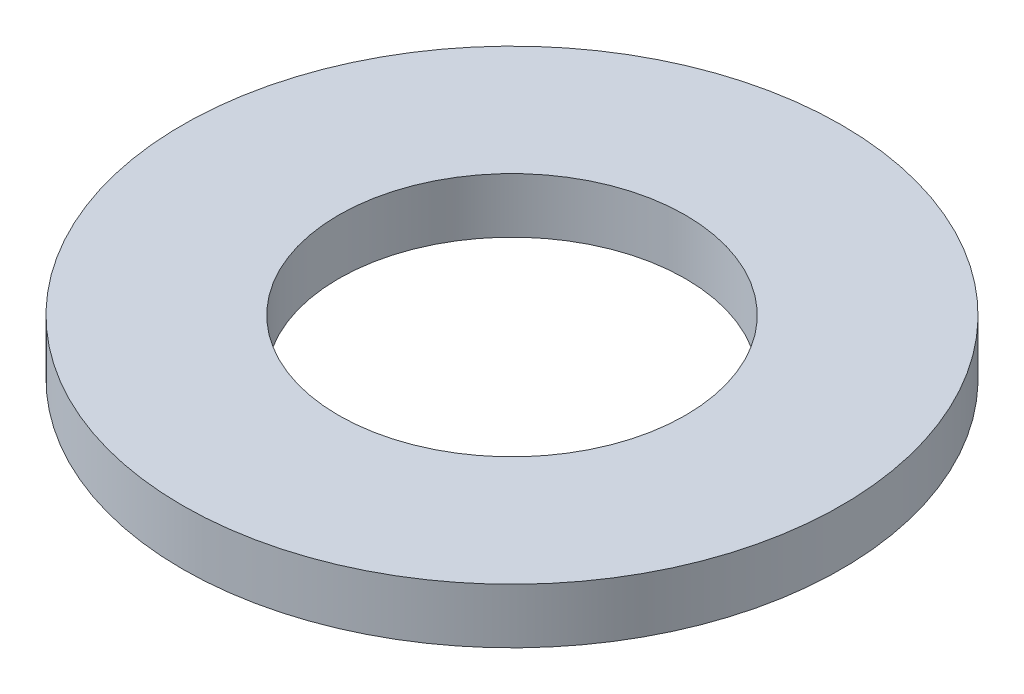
ISO-10303-21;
HEADER;
FILE_DESCRIPTION(('STEP AP214'),'2;1');
FILE_NAME('part.step','',(''),(''),'','','');
FILE_SCHEMA(('AUTOMOTIVE_DESIGN { 1 0 10303 214 1 1 1 1 }'));
ENDSEC;
DATA;
#1=APPLICATION_CONTEXT('core data for automotive mechanical design processes');
#2=APPLICATION_PROTOCOL_DEFINITION('international standard','automotive_design',2000,#1);
#3=PRODUCT_CONTEXT('',#1,'mechanical');
#4=PRODUCT('Part','Part','',(#3));
#5=PRODUCT_RELATED_PRODUCT_CATEGORY('part','',(#4));
#6=PRODUCT_DEFINITION_FORMATION('','',#4);
#7=PRODUCT_DEFINITION_CONTEXT('part definition',#1,'design');
#8=PRODUCT_DEFINITION('design','',#6,#7);
#9=PRODUCT_DEFINITION_SHAPE('','',#8);
#10=(LENGTH_UNIT() NAMED_UNIT(*) SI_UNIT(.MILLI.,.METRE.));
#11=(NAMED_UNIT(*) PLANE_ANGLE_UNIT() SI_UNIT($,.RADIAN.));
#12=(NAMED_UNIT(*) SI_UNIT($,.STERADIAN.) SOLID_ANGLE_UNIT());
#13=UNCERTAINTY_MEASURE_WITH_UNIT(LENGTH_MEASURE(1.E-05),#10,'distance_accuracy_value','');
#14=(GEOMETRIC_REPRESENTATION_CONTEXT(3) GLOBAL_UNCERTAINTY_ASSIGNED_CONTEXT((#13)) GLOBAL_UNIT_ASSIGNED_CONTEXT((#10,
#11,#12)) REPRESENTATION_CONTEXT('',''));
#15=CARTESIAN_POINT('',(0.,0.,0.));
#16=DIRECTION('',(0.,0.,1.));
#17=DIRECTION('',(1.,0.,0.));
#18=AXIS2_PLACEMENT_3D('',#15,#16,#17);
#19=CARTESIAN_POINT('',(0.,6.35,0.));
#20=DIRECTION('',(0.,1.,0.));
#21=DIRECTION('',(0.,0.,1.));
#22=AXIS2_PLACEMENT_3D('',#19,#20,#21);
#23=PLANE('',#22);
#24=CARTESIAN_POINT('',(0.,6.35,0.));
#25=DIRECTION('',(0.,1.,0.));
#26=DIRECTION('',(0.,0.,1.));
#27=AXIS2_PLACEMENT_3D('',#24,#25,#26);
#28=CIRCLE('',#27,38.);
#29=CARTESIAN_POINT('',(0.,6.35,38.));
#30=VERTEX_POINT('',#29);
#31=EDGE_CURVE('E10',#30,#30,#28,.T.);
#32=ORIENTED_EDGE('',*,*,#31,.T.);
#33=EDGE_LOOP('',(#32));
#34=FACE_BOUND('',#33,.T.);
#35=CARTESIAN_POINT('',(0.,6.35,0.));
#36=DIRECTION('',(0.,1.,0.));
#37=DIRECTION('',(0.,0.,1.));
#38=AXIS2_PLACEMENT_3D('',#35,#36,#37);
#39=CIRCLE('',#38,20.);
#40=CARTESIAN_POINT('',(0.,6.35,20.));
#41=VERTEX_POINT('',#40);
#42=EDGE_CURVE('E52',#41,#41,#39,.T.);
#43=ORIENTED_EDGE('',*,*,#42,.F.);
#44=EDGE_LOOP('',(#43));
#45=FACE_BOUND('',#44,.T.);
#46=ADVANCED_FACE('F41',(#34,#45),#23,.T.);
#47=CARTESIAN_POINT('',(0.,0.,0.));
#48=DIRECTION('',(0.,1.,0.));
#49=DIRECTION('',(0.,0.,1.));
#50=AXIS2_PLACEMENT_3D('',#47,#48,#49);
#51=PLANE('',#50);
#52=CARTESIAN_POINT('',(0.,0.,0.));
#53=DIRECTION('',(0.,1.,0.));
#54=DIRECTION('',(0.,0.,1.));
#55=AXIS2_PLACEMENT_3D('',#52,#53,#54);
#56=CIRCLE('',#55,38.);
#57=CARTESIAN_POINT('',(0.,0.,38.));
#58=VERTEX_POINT('',#57);
#59=EDGE_CURVE('E45',#58,#58,#56,.T.);
#60=ORIENTED_EDGE('',*,*,#59,.F.);
#61=EDGE_LOOP('',(#60));
#62=FACE_BOUND('',#61,.T.);
#63=CARTESIAN_POINT('',(0.,0.,0.));
#64=DIRECTION('',(0.,1.,0.));
#65=DIRECTION('',(0.,0.,1.));
#66=AXIS2_PLACEMENT_3D('',#63,#64,#65);
#67=CIRCLE('',#66,20.);
#68=CARTESIAN_POINT('',(0.,0.,20.));
#69=VERTEX_POINT('',#68);
#70=EDGE_CURVE('E54',#69,#69,#67,.T.);
#71=ORIENTED_EDGE('',*,*,#70,.T.);
#72=EDGE_LOOP('',(#71));
#73=FACE_BOUND('',#72,.T.);
#74=ADVANCED_FACE('F64',(#62,#73),#51,.F.);
#75=CARTESIAN_POINT('',(0.,6.35,0.));
#76=DIRECTION('',(0.,-1.,0.));
#77=DIRECTION('',(0.,0.,-1.));
#78=AXIS2_PLACEMENT_3D('',#75,#76,#77);
#79=CYLINDRICAL_SURFACE('',#78,38.);
#80=ORIENTED_EDGE('',*,*,#31,.F.);
#81=EDGE_LOOP('',(#80));
#82=FACE_BOUND('',#81,.T.);
#83=ORIENTED_EDGE('',*,*,#59,.T.);
#84=EDGE_LOOP('',(#83));
#85=FACE_BOUND('',#84,.T.);
#86=ADVANCED_FACE('F43',(#82,#85),#79,.T.);
#87=CARTESIAN_POINT('',(0.,6.35,0.));
#88=DIRECTION('',(0.,-1.,0.));
#89=DIRECTION('',(0.,0.,-1.));
#90=AXIS2_PLACEMENT_3D('',#87,#88,#89);
#91=CYLINDRICAL_SURFACE('',#90,20.);
#92=ORIENTED_EDGE('',*,*,#42,.T.);
#93=EDGE_LOOP('',(#92));
#94=FACE_BOUND('',#93,.T.);
#95=ORIENTED_EDGE('',*,*,#70,.F.);
#96=EDGE_LOOP('',(#95));
#97=FACE_BOUND('',#96,.T.);
#98=ADVANCED_FACE('F60',(#94,#97),#91,.F.);
#99=CLOSED_SHELL('',(#46,#74,#86,#98));
#100=MANIFOLD_SOLID_BREP('B2',#99);
#101=ADVANCED_BREP_SHAPE_REPRESENTATION('',(#18,#100),#14);
#102=SHAPE_DEFINITION_REPRESENTATION(#9,#101);
ENDSEC;
END-ISO-10303-21;
